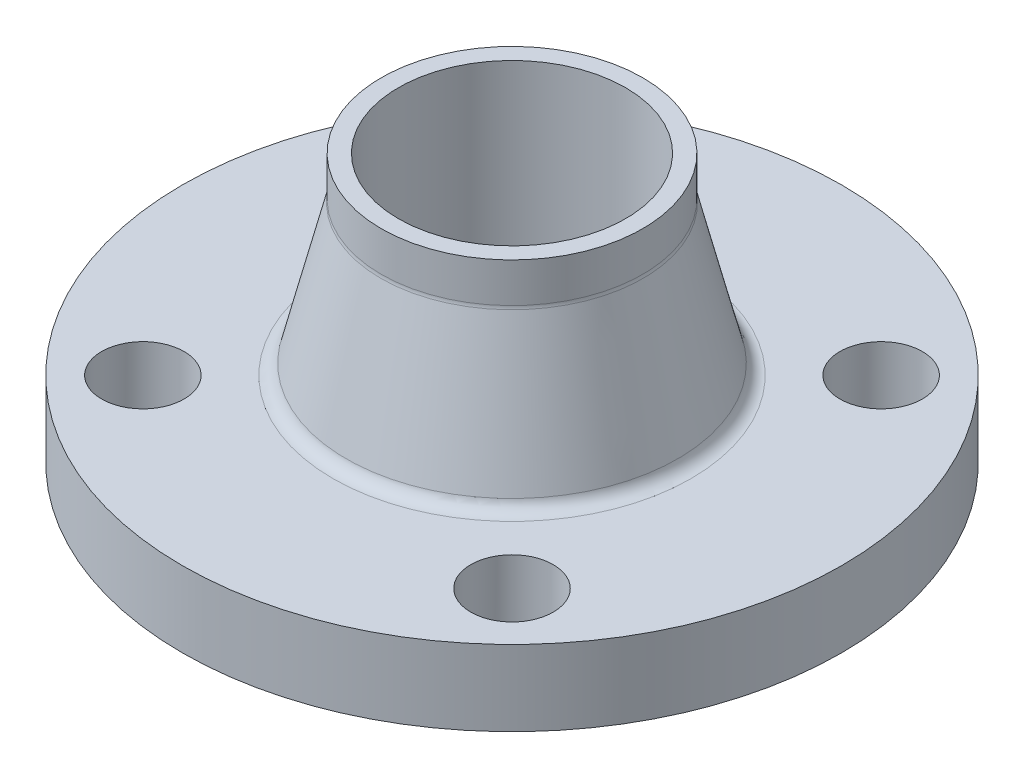
ISO-10303-21;
HEADER;
FILE_DESCRIPTION(('STEP AP214'),'2;1');
FILE_NAME('part.step','',(''),(''),'','','');
FILE_SCHEMA(('AUTOMOTIVE_DESIGN { 1 0 10303 214 1 1 1 1 }'));
ENDSEC;
DATA;
#1=APPLICATION_CONTEXT('core data for automotive mechanical design processes');
#2=APPLICATION_PROTOCOL_DEFINITION('international standard','automotive_design',2000,#1);
#3=PRODUCT_CONTEXT('',#1,'mechanical');
#4=PRODUCT('Part','Part','',(#3));
#5=PRODUCT_RELATED_PRODUCT_CATEGORY('part','',(#4));
#6=PRODUCT_DEFINITION_FORMATION('','',#4);
#7=PRODUCT_DEFINITION_CONTEXT('part definition',#1,'design');
#8=PRODUCT_DEFINITION('design','',#6,#7);
#9=PRODUCT_DEFINITION_SHAPE('','',#8);
#10=(LENGTH_UNIT() NAMED_UNIT(*) SI_UNIT(.MILLI.,.METRE.));
#11=(NAMED_UNIT(*) PLANE_ANGLE_UNIT() SI_UNIT($,.RADIAN.));
#12=(NAMED_UNIT(*) SI_UNIT($,.STERADIAN.) SOLID_ANGLE_UNIT());
#13=UNCERTAINTY_MEASURE_WITH_UNIT(LENGTH_MEASURE(1.E-05),#10,'distance_accuracy_value','');
#14=(GEOMETRIC_REPRESENTATION_CONTEXT(3) GLOBAL_UNCERTAINTY_ASSIGNED_CONTEXT((#13)) GLOBAL_UNIT_ASSIGNED_CONTEXT((#10,
#11,#12)) REPRESENTATION_CONTEXT('',''));
#15=CARTESIAN_POINT('',(0.,0.,0.));
#16=DIRECTION('',(0.,0.,1.));
#17=DIRECTION('',(1.,0.,0.));
#18=AXIS2_PLACEMENT_3D('',#15,#16,#17);
#19=CARTESIAN_POINT('',(30.226,61.9125,0.));
#20=DIRECTION('',(0.,1.,0.));
#21=DIRECTION('',(0.,0.,1.));
#22=AXIS2_PLACEMENT_3D('',#19,#20,#21);
#23=PLANE('',#22);
#24=CARTESIAN_POINT('',(0.,61.9125,0.));
#25=DIRECTION('',(0.,-1.,0.));
#26=DIRECTION('',(0.,0.,-1.));
#27=AXIS2_PLACEMENT_3D('',#24,#25,#26);
#28=CIRCLE('',#27,26.2509);
#29=CARTESIAN_POINT('',(0.,61.9125,-26.2509));
#30=VERTEX_POINT('',#29);
#31=EDGE_CURVE('E51',#30,#30,#28,.T.);
#32=ORIENTED_EDGE('',*,*,#31,.T.);
#33=EDGE_LOOP('',(#32));
#34=FACE_BOUND('',#33,.T.);
#35=CARTESIAN_POINT('',(0.,61.9125,0.));
#36=DIRECTION('',(0.,-1.,0.));
#37=DIRECTION('',(0.,0.,-1.));
#38=AXIS2_PLACEMENT_3D('',#35,#36,#37);
#39=CIRCLE('',#38,30.226);
#40=CARTESIAN_POINT('',(0.,61.9125,-30.226));
#41=VERTEX_POINT('',#40);
#42=EDGE_CURVE('E10',#41,#41,#39,.T.);
#43=ORIENTED_EDGE('',*,*,#42,.F.);
#44=EDGE_LOOP('',(#43));
#45=FACE_BOUND('',#44,.T.);
#46=ADVANCED_FACE('F32',(#34,#45),#23,.T.);
#47=CARTESIAN_POINT('',(0.,0.,0.));
#48=DIRECTION('',(0.,-1.,0.));
#49=DIRECTION('',(0.,0.,-1.));
#50=AXIS2_PLACEMENT_3D('',#47,#48,#49);
#51=CYLINDRICAL_SURFACE('',#50,30.226);
#52=ORIENTED_EDGE('',*,*,#42,.T.);
#53=EDGE_LOOP('',(#52));
#54=FACE_BOUND('',#53,.T.);
#55=CARTESIAN_POINT('',(0.,52.7756017265023,0.));
#56=DIRECTION('',(0.,-1.,0.));
#57=DIRECTION('',(0.,0.,-1.));
#58=AXIS2_PLACEMENT_3D('',#55,#56,#57);
#59=CIRCLE('',#58,30.226);
#60=CARTESIAN_POINT('',(0.,52.7756017265023,-30.226));
#61=VERTEX_POINT('',#60);
#62=EDGE_CURVE('E39',#61,#61,#59,.T.);
#63=ORIENTED_EDGE('',*,*,#62,.F.);
#64=EDGE_LOOP('',(#63));
#65=FACE_BOUND('',#64,.T.);
#66=ADVANCED_FACE('F103',(#54,#65),#51,.T.);
#67=CARTESIAN_POINT('',(0.,52.7756017265023,0.));
#68=DIRECTION('',(0.,-1.,0.));
#69=DIRECTION('',(0.,0.,-1.));
#70=AXIS2_PLACEMENT_3D('',#67,#68,#69);
#71=TOROIDAL_SURFACE('',#70,33.401,3.175);
#72=ORIENTED_EDGE('',*,*,#62,.T.);
#73=EDGE_LOOP('',(#72));
#74=FACE_BOUND('',#73,.T.);
#75=CARTESIAN_POINT('',(0.,52.0108254282836,0.));
#76=DIRECTION('',(0.,-1.,0.));
#77=DIRECTION('',(0.,0.,-1.));
#78=AXIS2_PLACEMENT_3D('',#75,#76,#77);
#79=CIRCLE('',#78,30.3194837800714);
#80=CARTESIAN_POINT('',(0.,52.0108254282836,-30.3194837800714));
#81=VERTEX_POINT('',#80);
#82=EDGE_CURVE('E44',#81,#81,#79,.T.);
#83=ORIENTED_EDGE('',*,*,#82,.F.);
#84=EDGE_LOOP('',(#83));
#85=FACE_BOUND('',#84,.T.);
#86=ADVANCED_FACE('F101',(#74,#85),#71,.F.);
#87=CARTESIAN_POINT('',(0.,19.8727237017813,0.));
#88=DIRECTION('',(0.,-1.,0.));
#89=DIRECTION('',(0.,0.,-1.));
#90=AXIS2_PLACEMENT_3D('',#87,#88,#89);
#91=CONICAL_SURFACE('',#90,38.295576299467,0.243266702462514);
#92=ORIENTED_EDGE('',*,*,#82,.T.);
#93=EDGE_LOOP('',(#92));
#94=FACE_BOUND('',#93,.T.);
#95=CARTESIAN_POINT('',(0.,19.8727237017813,0.));
#96=DIRECTION('',(0.,-1.,0.));
#97=DIRECTION('',(0.,0.,-1.));
#98=AXIS2_PLACEMENT_3D('',#95,#96,#97);
#99=CIRCLE('',#98,38.295576299467);
#100=CARTESIAN_POINT('',(0.,19.8727237017813,-38.295576299467));
#101=VERTEX_POINT('',#100);
#102=EDGE_CURVE('E93',#101,#101,#99,.T.);
#103=ORIENTED_EDGE('',*,*,#102,.F.);
#104=EDGE_LOOP('',(#103));
#105=FACE_BOUND('',#104,.T.);
#106=ADVANCED_FACE('F98',(#94,#105),#91,.T.);
#107=CARTESIAN_POINT('',(0.,20.6375,0.));
#108=DIRECTION('',(0.,-1.,0.));
#109=DIRECTION('',(0.,0.,-1.));
#110=AXIS2_PLACEMENT_3D('',#107,#108,#109);
#111=TOROIDAL_SURFACE('',#110,41.3770925193955,3.17499999999999);
#112=ORIENTED_EDGE('',*,*,#102,.T.);
#113=EDGE_LOOP('',(#112));
#114=FACE_BOUND('',#113,.T.);
#115=CARTESIAN_POINT('',(0.,17.4625,0.));
#116=DIRECTION('',(0.,-1.,0.));
#117=DIRECTION('',(0.,0.,-1.));
#118=AXIS2_PLACEMENT_3D('',#115,#116,#117);
#119=CIRCLE('',#118,41.3770925193955);
#120=CARTESIAN_POINT('',(0.,17.4625,-41.3770925193955));
#121=VERTEX_POINT('',#120);
#122=EDGE_CURVE('E90',#121,#121,#119,.T.);
#123=ORIENTED_EDGE('',*,*,#122,.F.);
#124=EDGE_LOOP('',(#123));
#125=FACE_BOUND('',#124,.T.);
#126=ADVANCED_FACE('F110',(#114,#125),#111,.F.);
#127=CARTESIAN_POINT('',(76.2,17.4625,0.));
#128=DIRECTION('',(0.,1.,0.));
#129=DIRECTION('',(0.,0.,1.));
#130=AXIS2_PLACEMENT_3D('',#127,#128,#129);
#131=PLANE('',#130);
#132=CARTESIAN_POINT('',(42.656216575079,17.4625,-42.656216575078));
#133=DIRECTION('',(0.,1.,0.));
#134=DIRECTION('',(1.,0.,0.));
#135=AXIS2_PLACEMENT_3D('',#132,#133,#134);
#136=CIRCLE('',#135,9.525);
#137=CARTESIAN_POINT('',(52.181216575079,17.4625,-42.6562165750779));
#138=VERTEX_POINT('',#137);
#139=EDGE_CURVE('E68',#138,#138,#136,.T.);
#140=ORIENTED_EDGE('',*,*,#139,.F.);
#141=EDGE_LOOP('',(#140));
#142=FACE_BOUND('',#141,.T.);
#143=CARTESIAN_POINT('',(-42.6562165750781,17.4625,-42.6562165750789));
#144=DIRECTION('',(0.,1.,0.));
#145=DIRECTION('',(0.,0.,-1.));
#146=AXIS2_PLACEMENT_3D('',#143,#144,#145);
#147=CIRCLE('',#146,9.525);
#148=CARTESIAN_POINT('',(-42.656216575078,17.4625,-52.1812165750788));
#149=VERTEX_POINT('',#148);
#150=EDGE_CURVE('E58',#149,#149,#147,.T.);
#151=ORIENTED_EDGE('',*,*,#150,.F.);
#152=EDGE_LOOP('',(#151));
#153=FACE_BOUND('',#152,.T.);
#154=CARTESIAN_POINT('',(-42.6562165750787,17.4625,42.6562165750783));
#155=DIRECTION('',(0.,1.,0.));
#156=DIRECTION('',(-1.,0.,0.));
#157=AXIS2_PLACEMENT_3D('',#154,#155,#156);
#158=CIRCLE('',#157,9.525);
#159=CARTESIAN_POINT('',(-52.1812165750787,17.4625,42.6562165750782));
#160=VERTEX_POINT('',#159);
#161=EDGE_CURVE('E55',#160,#160,#158,.T.);
#162=ORIENTED_EDGE('',*,*,#161,.F.);
#163=EDGE_LOOP('',(#162));
#164=FACE_BOUND('',#163,.T.);
#165=CARTESIAN_POINT('',(42.6562165750784,17.4625,42.6562165750786));
#166=DIRECTION('',(0.,1.,0.));
#167=DIRECTION('',(0.,0.,1.));
#168=AXIS2_PLACEMENT_3D('',#165,#166,#167);
#169=CIRCLE('',#168,9.525);
#170=CARTESIAN_POINT('',(42.6562165750784,17.4625,52.1812165750786));
#171=VERTEX_POINT('',#170);
#172=EDGE_CURVE('E52',#171,#171,#169,.T.);
#173=ORIENTED_EDGE('',*,*,#172,.F.);
#174=EDGE_LOOP('',(#173));
#175=FACE_BOUND('',#174,.T.);
#176=ORIENTED_EDGE('',*,*,#122,.T.);
#177=EDGE_LOOP('',(#176));
#178=FACE_BOUND('',#177,.T.);
#179=CARTESIAN_POINT('',(0.,17.4625,0.));
#180=DIRECTION('',(0.,-1.,0.));
#181=DIRECTION('',(0.,0.,-1.));
#182=AXIS2_PLACEMENT_3D('',#179,#180,#181);
#183=CIRCLE('',#182,76.2);
#184=CARTESIAN_POINT('',(0.,17.4625,-76.2));
#185=VERTEX_POINT('',#184);
#186=EDGE_CURVE('E87',#185,#185,#183,.T.);
#187=ORIENTED_EDGE('',*,*,#186,.F.);
#188=EDGE_LOOP('',(#187));
#189=FACE_BOUND('',#188,.T.);
#190=ADVANCED_FACE('F147',(#142,#153,#164,#175,#178,#189),#131,.T.);
#191=CARTESIAN_POINT('',(0.,0.,0.));
#192=DIRECTION('',(0.,-1.,0.));
#193=DIRECTION('',(0.,0.,-1.));
#194=AXIS2_PLACEMENT_3D('',#191,#192,#193);
#195=CYLINDRICAL_SURFACE('',#194,76.2);
#196=ORIENTED_EDGE('',*,*,#186,.T.);
#197=EDGE_LOOP('',(#196));
#198=FACE_BOUND('',#197,.T.);
#199=CARTESIAN_POINT('',(0.,0.,0.));
#200=DIRECTION('',(0.,-1.,0.));
#201=DIRECTION('',(0.,0.,-1.));
#202=AXIS2_PLACEMENT_3D('',#199,#200,#201);
#203=CIRCLE('',#202,76.2);
#204=CARTESIAN_POINT('',(0.,0.,-76.2));
#205=VERTEX_POINT('',#204);
#206=EDGE_CURVE('E84',#205,#205,#203,.T.);
#207=ORIENTED_EDGE('',*,*,#206,.F.);
#208=EDGE_LOOP('',(#207));
#209=FACE_BOUND('',#208,.T.);
#210=ADVANCED_FACE('F143',(#198,#209),#195,.T.);
#211=CARTESIAN_POINT('',(46.0375,0.,0.));
#212=DIRECTION('',(0.,-1.,0.));
#213=DIRECTION('',(0.,0.,-1.));
#214=AXIS2_PLACEMENT_3D('',#211,#212,#213);
#215=PLANE('',#214);
#216=CARTESIAN_POINT('',(42.656216575079,0.,-42.656216575078));
#217=DIRECTION('',(0.,-1.,0.));
#218=DIRECTION('',(0.,0.,-1.));
#219=AXIS2_PLACEMENT_3D('',#216,#217,#218);
#220=CIRCLE('',#219,9.525);
#221=CARTESIAN_POINT('',(42.656216575079,0.,-52.181216575078));
#222=VERTEX_POINT('',#221);
#223=EDGE_CURVE('E35',#222,#222,#220,.T.);
#224=ORIENTED_EDGE('',*,*,#223,.F.);
#225=EDGE_LOOP('',(#224));
#226=FACE_BOUND('',#225,.T.);
#227=CARTESIAN_POINT('',(-42.6562165750781,0.,-42.6562165750789));
#228=DIRECTION('',(0.,-1.,0.));
#229=DIRECTION('',(0.,0.,-1.));
#230=AXIS2_PLACEMENT_3D('',#227,#228,#229);
#231=CIRCLE('',#230,9.525);
#232=CARTESIAN_POINT('',(-42.6562165750781,0.,-52.1812165750788));
#233=VERTEX_POINT('',#232);
#234=EDGE_CURVE('E56',#233,#233,#231,.T.);
#235=ORIENTED_EDGE('',*,*,#234,.F.);
#236=EDGE_LOOP('',(#235));
#237=FACE_BOUND('',#236,.T.);
#238=CARTESIAN_POINT('',(-42.6562165750787,0.,42.6562165750783));
#239=DIRECTION('',(0.,-1.,0.));
#240=DIRECTION('',(0.,0.,-1.));
#241=AXIS2_PLACEMENT_3D('',#238,#239,#240);
#242=CIRCLE('',#241,9.525);
#243=CARTESIAN_POINT('',(-42.6562165750787,0.,33.1312165750783));
#244=VERTEX_POINT('',#243);
#245=EDGE_CURVE('E53',#244,#244,#242,.T.);
#246=ORIENTED_EDGE('',*,*,#245,.F.);
#247=EDGE_LOOP('',(#246));
#248=FACE_BOUND('',#247,.T.);
#249=CARTESIAN_POINT('',(42.6562165750784,0.,42.6562165750786));
#250=DIRECTION('',(0.,-1.,0.));
#251=DIRECTION('',(0.,0.,-1.));
#252=AXIS2_PLACEMENT_3D('',#249,#250,#251);
#253=CIRCLE('',#252,9.525);
#254=CARTESIAN_POINT('',(42.6562165750784,0.,33.1312165750786));
#255=VERTEX_POINT('',#254);
#256=EDGE_CURVE('E48',#255,#255,#253,.T.);
#257=ORIENTED_EDGE('',*,*,#256,.F.);
#258=EDGE_LOOP('',(#257));
#259=FACE_BOUND('',#258,.T.);
#260=ORIENTED_EDGE('',*,*,#206,.T.);
#261=EDGE_LOOP('',(#260));
#262=FACE_BOUND('',#261,.T.);
#263=CARTESIAN_POINT('',(0.,0.,0.));
#264=DIRECTION('',(0.,-1.,0.));
#265=DIRECTION('',(0.,0.,-1.));
#266=AXIS2_PLACEMENT_3D('',#263,#264,#265);
#267=CIRCLE('',#266,46.0375);
#268=CARTESIAN_POINT('',(0.,0.,-46.0375));
#269=VERTEX_POINT('',#268);
#270=EDGE_CURVE('E81',#269,#269,#267,.T.);
#271=ORIENTED_EDGE('',*,*,#270,.F.);
#272=EDGE_LOOP('',(#271));
#273=FACE_BOUND('',#272,.T.);
#274=ADVANCED_FACE('F139',(#226,#237,#248,#259,#262,#273),#215,.T.);
#275=CARTESIAN_POINT('',(0.,0.,0.));
#276=DIRECTION('',(0.,-1.,0.));
#277=DIRECTION('',(0.,0.,-1.));
#278=AXIS2_PLACEMENT_3D('',#275,#276,#277);
#279=CYLINDRICAL_SURFACE('',#278,46.0375);
#280=ORIENTED_EDGE('',*,*,#270,.T.);
#281=EDGE_LOOP('',(#280));
#282=FACE_BOUND('',#281,.T.);
#283=CARTESIAN_POINT('',(0.,-1.5875,0.));
#284=DIRECTION('',(0.,-1.,0.));
#285=DIRECTION('',(0.,0.,-1.));
#286=AXIS2_PLACEMENT_3D('',#283,#284,#285);
#287=CIRCLE('',#286,46.0375);
#288=CARTESIAN_POINT('',(0.,-1.5875,-46.0375));
#289=VERTEX_POINT('',#288);
#290=EDGE_CURVE('E78',#289,#289,#287,.T.);
#291=ORIENTED_EDGE('',*,*,#290,.F.);
#292=EDGE_LOOP('',(#291));
#293=FACE_BOUND('',#292,.T.);
#294=ADVANCED_FACE('F132',(#282,#293),#279,.T.);
#295=CARTESIAN_POINT('',(26.2509,-1.5875,0.));
#296=DIRECTION('',(0.,-1.,0.));
#297=DIRECTION('',(0.,0.,-1.));
#298=AXIS2_PLACEMENT_3D('',#295,#296,#297);
#299=PLANE('',#298);
#300=ORIENTED_EDGE('',*,*,#290,.T.);
#301=EDGE_LOOP('',(#300));
#302=FACE_BOUND('',#301,.T.);
#303=CARTESIAN_POINT('',(0.,-1.58750000000001,0.));
#304=DIRECTION('',(0.,-1.,0.));
#305=DIRECTION('',(0.,0.,-1.));
#306=AXIS2_PLACEMENT_3D('',#303,#304,#305);
#307=CIRCLE('',#306,26.2509);
#308=CARTESIAN_POINT('',(0.,-1.58750000000001,-26.2509));
#309=VERTEX_POINT('',#308);
#310=EDGE_CURVE('E75',#309,#309,#307,.T.);
#311=ORIENTED_EDGE('',*,*,#310,.F.);
#312=EDGE_LOOP('',(#311));
#313=FACE_BOUND('',#312,.T.);
#314=ADVANCED_FACE('F122',(#302,#313),#299,.T.);
#315=CARTESIAN_POINT('',(0.,0.,0.));
#316=DIRECTION('',(0.,-1.,0.));
#317=DIRECTION('',(0.,0.,-1.));
#318=AXIS2_PLACEMENT_3D('',#315,#316,#317);
#319=CYLINDRICAL_SURFACE('',#318,26.2509);
#320=ORIENTED_EDGE('',*,*,#310,.T.);
#321=EDGE_LOOP('',(#320));
#322=FACE_BOUND('',#321,.T.);
#323=ORIENTED_EDGE('',*,*,#31,.F.);
#324=EDGE_LOOP('',(#323));
#325=FACE_BOUND('',#324,.T.);
#326=ADVANCED_FACE('F119',(#322,#325),#319,.F.);
#327=CARTESIAN_POINT('',(42.6562165750784,-1.58750000000001,42.6562165750786));
#328=DIRECTION('',(0.,1.,0.));
#329=DIRECTION('',(0.,0.,1.));
#330=AXIS2_PLACEMENT_3D('',#327,#328,#329);
#331=CYLINDRICAL_SURFACE('',#330,9.525);
#332=ORIENTED_EDGE('',*,*,#256,.T.);
#333=EDGE_LOOP('',(#332));
#334=FACE_BOUND('',#333,.T.);
#335=ORIENTED_EDGE('',*,*,#172,.T.);
#336=EDGE_LOOP('',(#335));
#337=FACE_BOUND('',#336,.T.);
#338=ADVANCED_FACE('F121',(#334,#337),#331,.F.);
#339=CARTESIAN_POINT('',(-42.6562165750787,-1.58750000000001,42.6562165750783));
#340=DIRECTION('',(0.,1.,0.));
#341=DIRECTION('',(0.,0.,1.));
#342=AXIS2_PLACEMENT_3D('',#339,#340,#341);
#343=CYLINDRICAL_SURFACE('',#342,9.525);
#344=ORIENTED_EDGE('',*,*,#245,.T.);
#345=EDGE_LOOP('',(#344));
#346=FACE_BOUND('',#345,.T.);
#347=ORIENTED_EDGE('',*,*,#161,.T.);
#348=EDGE_LOOP('',(#347));
#349=FACE_BOUND('',#348,.T.);
#350=ADVANCED_FACE('F129',(#346,#349),#343,.F.);
#351=CARTESIAN_POINT('',(-42.6562165750781,-1.58750000000001,-42.6562165750789));
#352=DIRECTION('',(0.,1.,0.));
#353=DIRECTION('',(0.,0.,1.));
#354=AXIS2_PLACEMENT_3D('',#351,#352,#353);
#355=CYLINDRICAL_SURFACE('',#354,9.525);
#356=ORIENTED_EDGE('',*,*,#234,.T.);
#357=EDGE_LOOP('',(#356));
#358=FACE_BOUND('',#357,.T.);
#359=ORIENTED_EDGE('',*,*,#150,.T.);
#360=EDGE_LOOP('',(#359));
#361=FACE_BOUND('',#360,.T.);
#362=ADVANCED_FACE('F212',(#358,#361),#355,.F.);
#363=CARTESIAN_POINT('',(42.656216575079,-1.58750000000001,-42.656216575078));
#364=DIRECTION('',(0.,1.,0.));
#365=DIRECTION('',(0.,0.,1.));
#366=AXIS2_PLACEMENT_3D('',#363,#364,#365);
#367=CYLINDRICAL_SURFACE('',#366,9.525);
#368=ORIENTED_EDGE('',*,*,#223,.T.);
#369=EDGE_LOOP('',(#368));
#370=FACE_BOUND('',#369,.T.);
#371=ORIENTED_EDGE('',*,*,#139,.T.);
#372=EDGE_LOOP('',(#371));
#373=FACE_BOUND('',#372,.T.);
#374=ADVANCED_FACE('F218',(#370,#373),#367,.F.);
#375=CLOSED_SHELL('',(#46,#66,#86,#106,#126,#190,#210,#274,#294,#314,#326,#338,#350,#362,#374));
#376=MANIFOLD_SOLID_BREP('B2',#375);
#377=ADVANCED_BREP_SHAPE_REPRESENTATION('',(#18,#376),#14);
#378=SHAPE_DEFINITION_REPRESENTATION(#9,#377);
ENDSEC;
END-ISO-10303-21;
